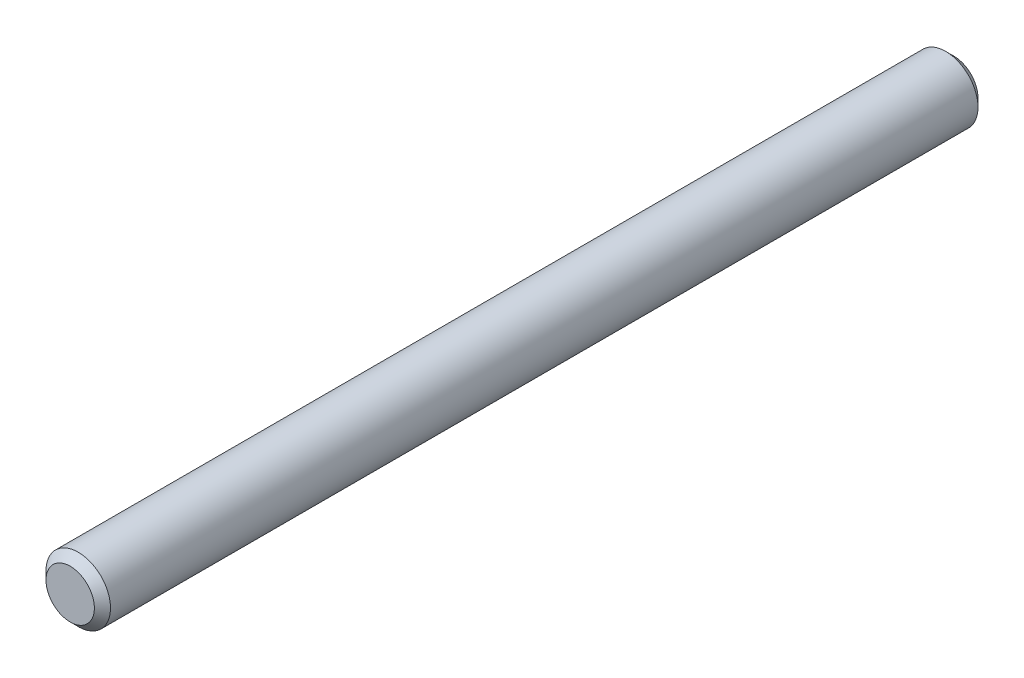
ISO-10303-21;
HEADER;
FILE_DESCRIPTION(('STEP AP214'),'2;1');
FILE_NAME('part.step','',(''),(''),'','','');
FILE_SCHEMA(('AUTOMOTIVE_DESIGN { 1 0 10303 214 1 1 1 1 }'));
ENDSEC;
DATA;
#1=APPLICATION_CONTEXT('core data for automotive mechanical design processes');
#2=APPLICATION_PROTOCOL_DEFINITION('international standard','automotive_design',2000,#1);
#3=PRODUCT_CONTEXT('',#1,'mechanical');
#4=PRODUCT('Part','Part','',(#3));
#5=PRODUCT_RELATED_PRODUCT_CATEGORY('part','',(#4));
#6=PRODUCT_DEFINITION_FORMATION('','',#4);
#7=PRODUCT_DEFINITION_CONTEXT('part definition',#1,'design');
#8=PRODUCT_DEFINITION('design','',#6,#7);
#9=PRODUCT_DEFINITION_SHAPE('','',#8);
#10=(LENGTH_UNIT() NAMED_UNIT(*) SI_UNIT(.MILLI.,.METRE.));
#11=(NAMED_UNIT(*) PLANE_ANGLE_UNIT() SI_UNIT($,.RADIAN.));
#12=(NAMED_UNIT(*) SI_UNIT($,.STERADIAN.) SOLID_ANGLE_UNIT());
#13=UNCERTAINTY_MEASURE_WITH_UNIT(LENGTH_MEASURE(1.E-05),#10,'distance_accuracy_value','');
#14=(GEOMETRIC_REPRESENTATION_CONTEXT(3) GLOBAL_UNCERTAINTY_ASSIGNED_CONTEXT((#13)) GLOBAL_UNIT_ASSIGNED_CONTEXT((#10,
#11,#12)) REPRESENTATION_CONTEXT('',''));
#15=CARTESIAN_POINT('',(0.,0.,0.));
#16=DIRECTION('',(0.,0.,1.));
#17=DIRECTION('',(1.,0.,0.));
#18=AXIS2_PLACEMENT_3D('',#15,#16,#17);
#19=CARTESIAN_POINT('',(0.,0.,-41.5));
#20=DIRECTION('',(0.,0.,1.));
#21=DIRECTION('',(1.,0.,0.));
#22=AXIS2_PLACEMENT_3D('',#19,#20,#21);
#23=PLANE('',#22);
#24=CARTESIAN_POINT('',(0.,0.,-41.499999999985));
#25=DIRECTION('',(0.,0.,1.));
#26=DIRECTION('',(1.,0.,0.));
#27=AXIS2_PLACEMENT_3D('',#24,#25,#26);
#28=CIRCLE('',#27,1.13624999994499);
#29=CARTESIAN_POINT('',(1.13624999994499,0.,-41.499999999985));
#30=VERTEX_POINT('',#29);
#31=EDGE_CURVE('E18',#30,#30,#28,.T.);
#32=ORIENTED_EDGE('',*,*,#31,.F.);
#33=EDGE_LOOP('',(#32));
#34=FACE_BOUND('',#33,.T.);
#35=ADVANCED_FACE('F15',(#34),#23,.F.);
#36=CARTESIAN_POINT('',(0.,0.,0.));
#37=DIRECTION('',(0.,0.,1.));
#38=DIRECTION('',(1.,0.,0.));
#39=AXIS2_PLACEMENT_3D('',#36,#37,#38);
#40=PLANE('',#39);
#41=CARTESIAN_POINT('',(0.,0.,5.6843418860808E-11));
#42=DIRECTION('',(0.,0.,-1.));
#43=DIRECTION('',(-1.,0.,0.));
#44=AXIS2_PLACEMENT_3D('',#41,#42,#43);
#45=CIRCLE('',#44,1.13625000000184);
#46=CARTESIAN_POINT('',(-1.13625000000184,0.,5.6843418860808E-11));
#47=VERTEX_POINT('',#46);
#48=EDGE_CURVE('E27',#47,#47,#45,.T.);
#49=ORIENTED_EDGE('',*,*,#48,.F.);
#50=EDGE_LOOP('',(#49));
#51=FACE_BOUND('',#50,.T.);
#52=ADVANCED_FACE('F39',(#51),#40,.T.);
#53=CARTESIAN_POINT('',(0.,0.,-41.1212499999465));
#54=DIRECTION('',(0.,0.,1.));
#55=DIRECTION('',(1.,0.,0.));
#56=AXIS2_PLACEMENT_3D('',#53,#54,#55);
#57=CONICAL_SURFACE('',#56,1.5149999999835,0.785398163397448);
#58=ORIENTED_EDGE('',*,*,#31,.T.);
#59=EDGE_LOOP('',(#58));
#60=FACE_BOUND('',#59,.T.);
#61=CARTESIAN_POINT('',(0.,0.,-41.12125));
#62=DIRECTION('',(0.,0.,-1.));
#63=DIRECTION('',(-1.,0.,0.));
#64=AXIS2_PLACEMENT_3D('',#61,#62,#63);
#65=CIRCLE('',#64,1.515);
#66=CARTESIAN_POINT('',(-1.515,0.,-41.12125));
#67=VERTEX_POINT('',#66);
#68=EDGE_CURVE('E22',#67,#67,#65,.F.);
#69=ORIENTED_EDGE('',*,*,#68,.F.);
#70=EDGE_LOOP('',(#69));
#71=FACE_BOUND('',#70,.T.);
#72=ADVANCED_FACE('F35',(#60,#71),#57,.T.);
#73=CARTESIAN_POINT('',(0.,0.,-0.378749999924821));
#74=DIRECTION('',(0.,0.,-1.));
#75=DIRECTION('',(-1.,0.,0.));
#76=AXIS2_PLACEMENT_3D('',#73,#74,#75);
#77=CONICAL_SURFACE('',#76,1.51499999992666,0.785398163322408);
#78=CARTESIAN_POINT('',(0.,0.,-0.37875));
#79=DIRECTION('',(0.,0.,-1.));
#80=DIRECTION('',(-1.,0.,0.));
#81=AXIS2_PLACEMENT_3D('',#78,#79,#80);
#82=CIRCLE('',#81,1.515);
#83=CARTESIAN_POINT('',(-1.515,0.,-0.37875));
#84=VERTEX_POINT('',#83);
#85=EDGE_CURVE('E10',#84,#84,#82,.T.);
#86=ORIENTED_EDGE('',*,*,#85,.F.);
#87=EDGE_LOOP('',(#86));
#88=FACE_BOUND('',#87,.T.);
#89=ORIENTED_EDGE('',*,*,#48,.T.);
#90=EDGE_LOOP('',(#89));
#91=FACE_BOUND('',#90,.T.);
#92=ADVANCED_FACE('F47',(#88,#91),#77,.T.);
#93=CARTESIAN_POINT('',(0.,0.,-0.37875));
#94=DIRECTION('',(0.,0.,-1.));
#95=DIRECTION('',(-1.,0.,0.));
#96=AXIS2_PLACEMENT_3D('',#93,#94,#95);
#97=CYLINDRICAL_SURFACE('',#96,1.515);
#98=ORIENTED_EDGE('',*,*,#68,.T.);
#99=EDGE_LOOP('',(#98));
#100=FACE_BOUND('',#99,.T.);
#101=ORIENTED_EDGE('',*,*,#85,.T.);
#102=EDGE_LOOP('',(#101));
#103=FACE_BOUND('',#102,.T.);
#104=ADVANCED_FACE('F45',(#100,#103),#97,.T.);
#105=CLOSED_SHELL('',(#35,#52,#72,#92,#104));
#106=MANIFOLD_SOLID_BREP('B1',#105);
#107=ADVANCED_BREP_SHAPE_REPRESENTATION('',(#18,#106),#14);
#108=SHAPE_DEFINITION_REPRESENTATION(#9,#107);
ENDSEC;
END-ISO-10303-21;
